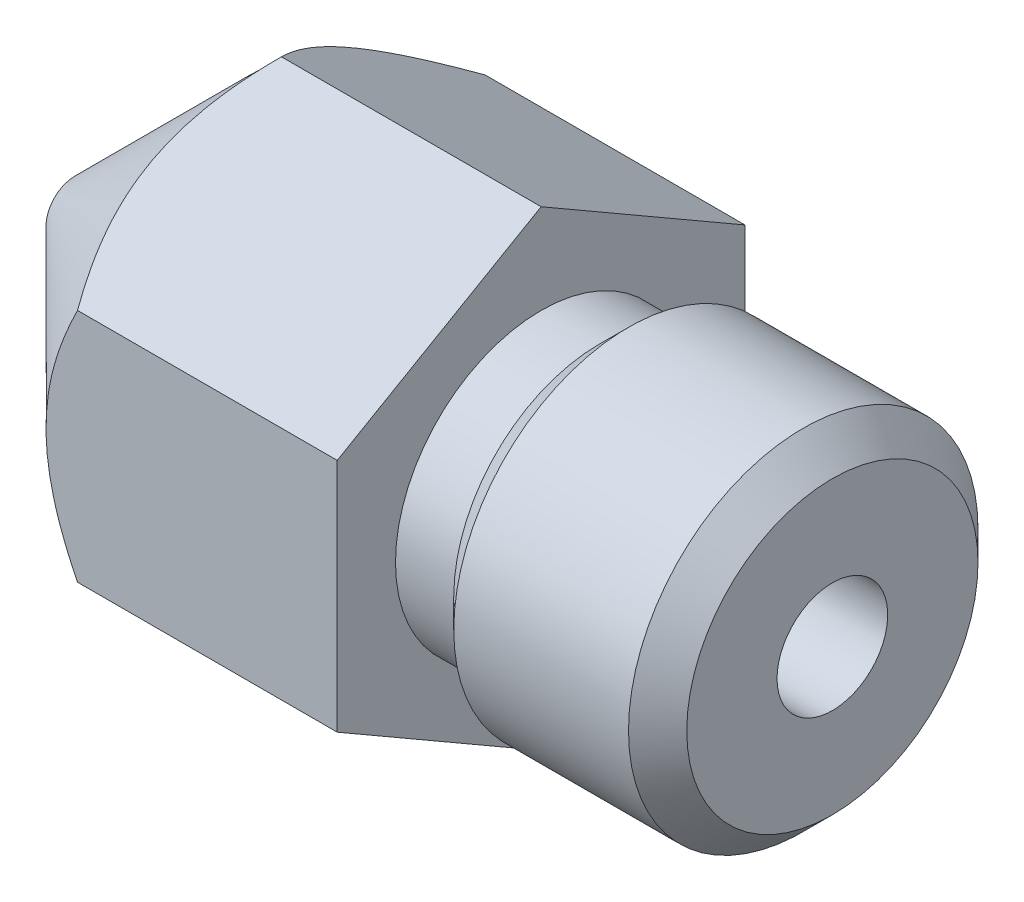
ISO-10303-21;
HEADER;
FILE_DESCRIPTION(('STEP AP214'),'2;1');
FILE_NAME('part.step','',(''),(''),'','','');
FILE_SCHEMA(('AUTOMOTIVE_DESIGN { 1 0 10303 214 1 1 1 1 }'));
ENDSEC;
DATA;
#1=APPLICATION_CONTEXT('core data for automotive mechanical design processes');
#2=APPLICATION_PROTOCOL_DEFINITION('international standard','automotive_design',2000,#1);
#3=PRODUCT_CONTEXT('',#1,'mechanical');
#4=PRODUCT('Part','Part','',(#3));
#5=PRODUCT_RELATED_PRODUCT_CATEGORY('part','',(#4));
#6=PRODUCT_DEFINITION_FORMATION('','',#4);
#7=PRODUCT_DEFINITION_CONTEXT('part definition',#1,'design');
#8=PRODUCT_DEFINITION('design','',#6,#7);
#9=PRODUCT_DEFINITION_SHAPE('','',#8);
#10=(LENGTH_UNIT() NAMED_UNIT(*) SI_UNIT(.MILLI.,.METRE.));
#11=(NAMED_UNIT(*) PLANE_ANGLE_UNIT() SI_UNIT($,.RADIAN.));
#12=(NAMED_UNIT(*) SI_UNIT($,.STERADIAN.) SOLID_ANGLE_UNIT());
#13=UNCERTAINTY_MEASURE_WITH_UNIT(LENGTH_MEASURE(1.E-05),#10,'distance_accuracy_value','');
#14=(GEOMETRIC_REPRESENTATION_CONTEXT(3) GLOBAL_UNCERTAINTY_ASSIGNED_CONTEXT((#13)) GLOBAL_UNIT_ASSIGNED_CONTEXT((#10,
#11,#12)) REPRESENTATION_CONTEXT('',''));
#15=CARTESIAN_POINT('',(0.,0.,0.));
#16=DIRECTION('',(0.,0.,1.));
#17=DIRECTION('',(1.,0.,0.));
#18=AXIS2_PLACEMENT_3D('',#15,#16,#17);
#19=CARTESIAN_POINT('',(8.,2.5,0.));
#20=DIRECTION('',(-1.,0.,0.));
#21=DIRECTION('',(0.,0.,1.));
#22=AXIS2_PLACEMENT_3D('',#19,#20,#21);
#23=PLANE('',#22);
#24=CARTESIAN_POINT('',(8.,0.,0.));
#25=DIRECTION('',(-1.,0.,0.));
#26=DIRECTION('',(0.,0.,1.));
#27=AXIS2_PLACEMENT_3D('',#24,#25,#26);
#28=CIRCLE('',#27,2.5);
#29=CARTESIAN_POINT('',(8.,0.,2.5));
#30=VERTEX_POINT('',#29);
#31=EDGE_CURVE('E131',#30,#30,#28,.T.);
#32=ORIENTED_EDGE('',*,*,#31,.T.);
#33=EDGE_LOOP('',(#32));
#34=FACE_BOUND('',#33,.T.);
#35=DIRECTION('',(0.,-1.,0.));
#36=VECTOR('',#35,1.);
#37=CARTESIAN_POINT('',(8.,2.02072594216369,3.5));
#38=LINE('',#37,#36);
#39=CARTESIAN_POINT('',(8.,2.02072594216369,3.5));
#40=VERTEX_POINT('',#39);
#41=CARTESIAN_POINT('',(8.,-2.02072594216369,3.5));
#42=VERTEX_POINT('',#41);
#43=EDGE_CURVE('E110',#40,#42,#38,.T.);
#44=ORIENTED_EDGE('',*,*,#43,.T.);
#45=DIRECTION('',(0.,-0.5,-0.866025403784439));
#46=VECTOR('',#45,1.);
#47=CARTESIAN_POINT('',(8.,-2.02072594216369,3.5));
#48=LINE('',#47,#46);
#49=CARTESIAN_POINT('',(8.,-4.04145188432738,0.));
#50=VERTEX_POINT('',#49);
#51=EDGE_CURVE('E108',#42,#50,#48,.T.);
#52=ORIENTED_EDGE('',*,*,#51,.T.);
#53=DIRECTION('',(0.,0.5,-0.866025403784439));
#54=VECTOR('',#53,1.);
#55=CARTESIAN_POINT('',(8.,-4.04145188432738,0.));
#56=LINE('',#55,#54);
#57=CARTESIAN_POINT('',(8.,-2.02072594216369,-3.5));
#58=VERTEX_POINT('',#57);
#59=EDGE_CURVE('E50',#50,#58,#56,.T.);
#60=ORIENTED_EDGE('',*,*,#59,.T.);
#61=DIRECTION('',(0.,1.,0.));
#62=VECTOR('',#61,1.);
#63=CARTESIAN_POINT('',(8.,-2.02072594216369,-3.5));
#64=LINE('',#63,#62);
#65=CARTESIAN_POINT('',(8.,2.02072594216369,-3.5));
#66=VERTEX_POINT('',#65);
#67=EDGE_CURVE('E98',#58,#66,#64,.T.);
#68=ORIENTED_EDGE('',*,*,#67,.T.);
#69=DIRECTION('',(0.,0.5,0.866025403784439));
#70=VECTOR('',#69,1.);
#71=CARTESIAN_POINT('',(8.,2.02072594216369,-3.5));
#72=LINE('',#71,#70);
#73=CARTESIAN_POINT('',(8.,4.04145188432738,0.));
#74=VERTEX_POINT('',#73);
#75=EDGE_CURVE('E104',#66,#74,#72,.T.);
#76=ORIENTED_EDGE('',*,*,#75,.T.);
#77=DIRECTION('',(0.,-0.5,0.866025403784439));
#78=VECTOR('',#77,1.);
#79=CARTESIAN_POINT('',(8.,4.04145188432738,0.));
#80=LINE('',#79,#78);
#81=EDGE_CURVE('E115',#74,#40,#80,.T.);
#82=ORIENTED_EDGE('',*,*,#81,.T.);
#83=EDGE_LOOP('',(#44,#52,#60,#68,#76,#82));
#84=FACE_BOUND('',#83,.T.);
#85=ADVANCED_FACE('F35',(#34,#84),#23,.F.);
#86=CARTESIAN_POINT('',(4.,0.,0.));
#87=DIRECTION('',(1.,0.,0.));
#88=DIRECTION('',(0.,0.,-1.));
#89=AXIS2_PLACEMENT_3D('',#86,#87,#88);
#90=CONICAL_SURFACE('',#89,4.5,0.78539816339745);
#91=CARTESIAN_POINT('',(0.,0.,0.));
#92=DIRECTION('',(-1.,0.,0.));
#93=DIRECTION('',(0.,0.,1.));
#94=AXIS2_PLACEMENT_3D('',#91,#92,#93);
#95=CIRCLE('',#94,0.499999999999984);
#96=CARTESIAN_POINT('',(0.,0.,0.499999999999984));
#97=VERTEX_POINT('',#96);
#98=EDGE_CURVE('E128',#97,#97,#95,.T.);
#99=ORIENTED_EDGE('',*,*,#98,.F.);
#100=EDGE_LOOP('',(#99));
#101=FACE_BOUND('',#100,.T.);
#102=CARTESIAN_POINT('',(5.60473460571073,-5.00177814443646,3.5));
#103=CARTESIAN_POINT('',(5.50158525305018,-4.87585100221837,3.5));
#104=CARTESIAN_POINT('',(5.39916732462682,-4.74931512243237,3.5));
#105=CARTESIAN_POINT('',(5.19618183428807,-4.49471658352455,3.5));
#106=CARTESIAN_POINT('',(5.09561475080956,-4.36665354335295,3.5));
#107=CARTESIAN_POINT('',(4.8956806099685,-4.1073404488107,3.5));
#108=CARTESIAN_POINT('',(4.79633882689846,-3.97607084326665,3.5));
#109=CARTESIAN_POINT('',(4.60061166670264,-3.71135912834578,3.5));
#110=CARTESIAN_POINT('',(4.50422600560764,-3.57791722953954,3.5));
#111=CARTESIAN_POINT('',(4.30644876507746,-3.29590423287125,3.5));
#112=CARTESIAN_POINT('',(4.20542063931455,-3.14707678989524,3.5));
#113=CARTESIAN_POINT('',(4.0092782092562,-2.84547482694549,3.5));
#114=CARTESIAN_POINT('',(3.91416582545941,-2.69269904772549,3.5));
#115=CARTESIAN_POINT('',(3.73242858701602,-2.38308612845867,3.5));
#116=CARTESIAN_POINT('',(3.64576650922454,-2.22627104221582,3.5));
#117=CARTESIAN_POINT('',(3.48347840457084,-1.90708387824138,3.5));
#118=CARTESIAN_POINT('',(3.4078428797255,-1.74471673355065,3.5));
#119=CARTESIAN_POINT('',(3.29115360790501,-1.46096984620552,3.5));
#120=CARTESIAN_POINT('',(3.24639235010286,-1.34112588832474,3.5));
#121=CARTESIAN_POINT('',(3.16645824704642,-1.09820885957048,3.5));
#122=CARTESIAN_POINT('',(3.13128671673046,-0.975135348396179,3.5));
#123=CARTESIAN_POINT('',(3.07315329237583,-0.728966718302567,3.5));
#124=CARTESIAN_POINT('',(3.04993834404319,-0.605932392197103,3.5));
#125=CARTESIAN_POINT('',(3.01613662323999,-0.358129563749721,3.5));
#126=CARTESIAN_POINT('',(3.00554687121748,-0.233361477610497,3.5));
#127=CARTESIAN_POINT('',(2.9980076393283,0.0101654253989616,3.5));
#128=CARTESIAN_POINT('',(3.0003849263801,0.128903431666411,3.5));
#129=CARTESIAN_POINT('',(3.01705527222058,0.365532552222858,3.5));
#130=CARTESIAN_POINT('',(3.03134918273084,0.483423605369748,3.5));
#131=CARTESIAN_POINT('',(3.07126805871322,0.719563148573866,3.5));
#132=CARTESIAN_POINT('',(3.09710502038985,0.83777515440585,3.5));
#133=CARTESIAN_POINT('',(3.15862164673052,1.07156228973921,3.5));
#134=CARTESIAN_POINT('',(3.19430109896366,1.1871374760929,3.5));
#135=CARTESIAN_POINT('',(3.27495249430218,1.41857905527411,3.5));
#136=CARTESIAN_POINT('',(3.32015561728366,1.53436386685402,3.5));
#137=CARTESIAN_POINT('',(3.41756542323519,1.7629573042304,3.5));
#138=CARTESIAN_POINT('',(3.46977427633029,1.87576499481178,3.5));
#139=CARTESIAN_POINT('',(3.57996695790531,2.09894682323399,3.5));
#140=CARTESIAN_POINT('',(3.63796861954407,2.20931208353451,3.5));
#141=CARTESIAN_POINT('',(3.75847190730103,2.42752018879847,3.5));
#142=CARTESIAN_POINT('',(3.82097285702742,2.53536340969175,3.5));
#143=CARTESIAN_POINT('',(3.94642001487544,2.74357548029041,3.5));
#144=CARTESIAN_POINT('',(4.00919138032335,2.8440502327273,3.5));
#145=CARTESIAN_POINT('',(4.13742428325754,3.04327327614903,3.5));
#146=CARTESIAN_POINT('',(4.20288602031573,3.14202143827798,3.5));
#147=CARTESIAN_POINT('',(4.33549374104825,3.33722918559784,3.5));
#148=CARTESIAN_POINT('',(4.40262218906713,3.43370072609763,3.5));
#149=CARTESIAN_POINT('',(4.53869269345195,3.62531773450166,3.5));
#150=CARTESIAN_POINT('',(4.60763424496689,3.72046356049015,3.5));
#151=CARTESIAN_POINT('',(4.67731849112517,3.81505265475415,3.5));
#152=B_SPLINE_CURVE_WITH_KNOTS('',3,(#102,#103,#104,#105,#106,#107,#108,#109,#110,#111,#112,
#113,#114,#115,#116,#117,#118,#119,#120,#121,#122,#123,#124,#125,#126,#127,#128,#129,#130,#131,
#132,#133,#134,#135,#136,#137,#138,#139,#140,#141,#142,#143,#144,#145,#146,#147,#148,#149,#150,
#151),.UNSPECIFIED.,.F.,.F.,(4,2,2,2,2,2,2,2,2,2,2,2,2,2,2,2,2,2,2,2,2,2,2,2,4),(0.,
0.488349249027166,0.976823010095185,1.47065642848088,1.96444225899961,2.50397255703355,
3.04367710477862,3.58088531780657,4.11762802448125,4.50109851017833,4.88462155073114,
5.25965435197999,5.63459862778907,5.99026775687149,6.34596230901475,6.70847660551895,
7.07098307847279,7.44358822460948,7.81630905811278,8.19021491747463,8.56406468333309,
8.91942809068196,9.27481790665746,9.62738125871665,9.97984745921805),.UNSPECIFIED.);
#153=CARTESIAN_POINT('',(3.54145188432738,2.02072594216369,3.5));
#154=VERTEX_POINT('',#153);
#155=CARTESIAN_POINT('',(3.54145188432738,-2.02072594216369,3.5));
#156=VERTEX_POINT('',#155);
#157=EDGE_CURVE('E176',#154,#156,#152,.F.);
#158=ORIENTED_EDGE('',*,*,#157,.F.);
#159=CARTESIAN_POINT('',(3.5415673593298,4.04156735438122,-0.000199999999999954));
#160=CARTESIAN_POINT('',(3.47216781805871,3.9721070606697,0.120108757817009));
#161=CARTESIAN_POINT('',(3.40684436318291,3.90148531215405,0.24242921436546));
#162=CARTESIAN_POINT('',(3.28723893601392,3.75747991147153,0.491853884911907));
#163=CARTESIAN_POINT('',(3.23302350720678,3.68408256574985,0.618981816842553));
#164=CARTESIAN_POINT('',(3.14015155956122,3.53608035685404,0.875329162282526));
#165=CARTESIAN_POINT('',(3.1012616245349,3.46151318117029,1.00448329914368));
#166=CARTESIAN_POINT('',(3.04134378872047,3.310737295381,1.26563479388695));
#167=CARTESIAN_POINT('',(3.02027116467501,3.2345331906662,1.39762417499828));
#168=CARTESIAN_POINT('',(3.00125799897574,3.10319782183117,1.62510370665135));
#169=CARTESIAN_POINT('',(2.99844358418733,3.04823615399913,1.72030010780516));
#170=CARTESIAN_POINT('',(3.00318657176733,2.93840222621347,1.91053805112478));
#171=CARTESIAN_POINT('',(3.0107476100844,2.88353000435281,2.00557952731163));
#172=CARTESIAN_POINT('',(3.03580978058179,2.77430542200351,2.1947620533761));
#173=CARTESIAN_POINT('',(3.0533220307075,2.71995371223668,2.2889019761705));
#174=CARTESIAN_POINT('',(3.09733078172171,2.61218376551827,2.47556499941577));
#175=CARTESIAN_POINT('',(3.12382659379173,2.55876545732784,2.56808822325597));
#176=CARTESIAN_POINT('',(3.17833985376172,2.46393368006795,2.73234167964216));
#177=CARTESIAN_POINT('',(3.20492418817716,2.42231028209655,2.80443551971228));
#178=CARTESIAN_POINT('',(3.26237725929072,2.33981072759411,2.9473289397123));
#179=CARTESIAN_POINT('',(3.29324612649086,2.29893459386684,3.01812848014492));
#180=CARTESIAN_POINT('',(3.35857622497152,2.21805834837751,3.15821024645785));
#181=CARTESIAN_POINT('',(3.39302615997836,2.17805593632086,3.22749645656528));
#182=CARTESIAN_POINT('',(3.46506598404272,2.09879193666161,3.36478573118621));
#183=CARTESIAN_POINT('',(3.50265394638793,2.05952991236255,3.43278955208019));
#184=CARTESIAN_POINT('',(3.5415673593298,2.02061047210985,3.5002));
#185=B_SPLINE_CURVE_WITH_KNOTS('',3,(#159,#160,#161,#162,#163,#164,#165,#166,#167,#168,#169,
#170,#171,#172,#173,#174,#175,#176,#177,#178,#179,#180,#181,#182,#183,#184),.UNSPECIFIED.,.F.,
.F.,(4,2,2,2,2,2,2,2,2,2,2,2,4),(0.,0.466195029511835,0.935106055247667,1.3965703522971,
1.85687285909025,2.18628459516077,2.51581179896772,2.845707891424,3.17557869467338,
3.43762138891189,3.69967206642681,3.96091985737577,4.22200840855896),.UNSPECIFIED.);
#186=CARTESIAN_POINT('',(3.54145188432739,4.04145188432738,0.));
#187=VERTEX_POINT('',#186);
#188=EDGE_CURVE('E183',#187,#154,#185,.T.);
#189=ORIENTED_EDGE('',*,*,#188,.F.);
#190=CARTESIAN_POINT('',(3.5415673593298,2.02061047210985,-3.5002));
#191=CARTESIAN_POINT('',(3.47216781805871,2.09007076582137,-3.37989124218299));
#192=CARTESIAN_POINT('',(3.40684436318291,2.16069251433702,-3.25757078563454));
#193=CARTESIAN_POINT('',(3.28723893601392,2.30469791501955,-3.0081461150881));
#194=CARTESIAN_POINT('',(3.23302350720678,2.37809526074122,-2.88101818315745));
#195=CARTESIAN_POINT('',(3.14015155956122,2.52609746963704,-2.62467083771748));
#196=CARTESIAN_POINT('',(3.1012616245349,2.60066464532078,-2.49551670085632));
#197=CARTESIAN_POINT('',(3.04134378872047,2.75144053111008,-2.23436520611305));
#198=CARTESIAN_POINT('',(3.02027116467501,2.82764463582488,-2.10237582500172));
#199=CARTESIAN_POINT('',(3.00125799897574,2.9589800046599,-1.87489629334866));
#200=CARTESIAN_POINT('',(2.99844358418733,3.01394167249194,-1.77969989219485));
#201=CARTESIAN_POINT('',(3.00318657176733,3.12377560027761,-1.58946194887522));
#202=CARTESIAN_POINT('',(3.0107476100844,3.17864782213826,-1.49442047268838));
#203=CARTESIAN_POINT('',(3.03580978058179,3.28787240448756,-1.3052379466239));
#204=CARTESIAN_POINT('',(3.0533220307075,3.34222411425439,-1.2110980238295));
#205=CARTESIAN_POINT('',(3.09733078172171,3.4499940609728,-1.02443500058423));
#206=CARTESIAN_POINT('',(3.12382659379173,3.50341236916323,-0.931911776744036));
#207=CARTESIAN_POINT('',(3.17833985376172,3.59824414642313,-0.767658320357845));
#208=CARTESIAN_POINT('',(3.20492418817716,3.63986754439453,-0.69556448028772));
#209=CARTESIAN_POINT('',(3.26237725929072,3.72236709889696,-0.552671060287704));
#210=CARTESIAN_POINT('',(3.29324612649086,3.76324323262424,-0.481871519855082));
#211=CARTESIAN_POINT('',(3.35857622497152,3.84411947811356,-0.341789753542154));
#212=CARTESIAN_POINT('',(3.39302615997836,3.88412189017022,-0.272503543434724));
#213=CARTESIAN_POINT('',(3.46506598404272,3.96338588982946,-0.135214268813787));
#214=CARTESIAN_POINT('',(3.50265394638793,4.00264791412852,-0.0672104479198107));
#215=CARTESIAN_POINT('',(3.5415673593298,4.04156735438122,0.00020000000000017));
#216=B_SPLINE_CURVE_WITH_KNOTS('',3,(#190,#191,#192,#193,#194,#195,#196,#197,#198,#199,#200,
#201,#202,#203,#204,#205,#206,#207,#208,#209,#210,#211,#212,#213,#214,#215),.UNSPECIFIED.,.F.,
.F.,(4,2,2,2,2,2,2,2,2,2,2,2,4),(0.,0.466195029511835,0.935106055247667,1.3965703522971,
1.85687285909025,2.18628459516076,2.51581179896771,2.845707891424,3.17557869467337,
3.43762138891189,3.69967206642681,3.96091985737577,4.22200840855896),.UNSPECIFIED.);
#217=CARTESIAN_POINT('',(3.54145188432739,2.02072594216369,-3.5));
#218=VERTEX_POINT('',#217);
#219=EDGE_CURVE('E250',#218,#187,#216,.T.);
#220=ORIENTED_EDGE('',*,*,#219,.F.);
#221=CARTESIAN_POINT('',(5.60473460571074,-5.00177814443646,-3.5));
#222=CARTESIAN_POINT('',(5.50158525305018,-4.87585100221837,-3.5));
#223=CARTESIAN_POINT('',(5.39916732462683,-4.74931512243238,-3.5));
#224=CARTESIAN_POINT('',(5.19618183428808,-4.49471658352455,-3.5));
#225=CARTESIAN_POINT('',(5.09561475080957,-4.36665354335295,-3.5));
#226=CARTESIAN_POINT('',(4.8956806099685,-4.1073404488107,-3.5));
#227=CARTESIAN_POINT('',(4.79633882689846,-3.97607084326666,-3.5));
#228=CARTESIAN_POINT('',(4.60061166670265,-3.71135912834578,-3.5));
#229=CARTESIAN_POINT('',(4.50422600560765,-3.57791722953954,-3.5));
#230=CARTESIAN_POINT('',(4.30644876507746,-3.29590423287125,-3.5));
#231=CARTESIAN_POINT('',(4.20542063931455,-3.14707678989524,-3.5));
#232=CARTESIAN_POINT('',(4.00927820925621,-2.84547482694549,-3.5));
#233=CARTESIAN_POINT('',(3.91416582545942,-2.69269904772549,-3.5));
#234=CARTESIAN_POINT('',(3.73242858701603,-2.38308612845867,-3.5));
#235=CARTESIAN_POINT('',(3.64576650922454,-2.22627104221582,-3.5));
#236=CARTESIAN_POINT('',(3.48347840457084,-1.90708387824137,-3.5));
#237=CARTESIAN_POINT('',(3.4078428797255,-1.74471673355065,-3.5));
#238=CARTESIAN_POINT('',(3.29115360790502,-1.46096984620551,-3.5));
#239=CARTESIAN_POINT('',(3.24639235010286,-1.34112588832474,-3.5));
#240=CARTESIAN_POINT('',(3.16645824704642,-1.09820885957048,-3.5));
#241=CARTESIAN_POINT('',(3.13128671673046,-0.975135348396178,-3.5));
#242=CARTESIAN_POINT('',(3.07315329237583,-0.728966718302567,-3.5));
#243=CARTESIAN_POINT('',(3.04993834404319,-0.605932392197102,-3.5));
#244=CARTESIAN_POINT('',(3.01613662324,-0.358129563749721,-3.5));
#245=CARTESIAN_POINT('',(3.00554687121749,-0.233361477610496,-3.5));
#246=CARTESIAN_POINT('',(2.9980076393283,0.0101654253989624,-3.5));
#247=CARTESIAN_POINT('',(3.0003849263801,0.128903431666412,-3.5));
#248=CARTESIAN_POINT('',(3.01705527222059,0.365532552222859,-3.5));
#249=CARTESIAN_POINT('',(3.03134918273085,0.48342360536975,-3.5));
#250=CARTESIAN_POINT('',(3.07126805871322,0.719563148573868,-3.5));
#251=CARTESIAN_POINT('',(3.09710502038985,0.837775154405851,-3.5));
#252=CARTESIAN_POINT('',(3.15862164673053,1.07156228973921,-3.5));
#253=CARTESIAN_POINT('',(3.19430109896366,1.1871374760929,-3.5));
#254=CARTESIAN_POINT('',(3.27495249430218,1.41857905527411,-3.5));
#255=CARTESIAN_POINT('',(3.32015561728366,1.53436386685402,-3.5));
#256=CARTESIAN_POINT('',(3.41756542323519,1.76295730423041,-3.5));
#257=CARTESIAN_POINT('',(3.4697742763303,1.87576499481178,-3.5));
#258=CARTESIAN_POINT('',(3.57996695790532,2.09894682323399,-3.5));
#259=CARTESIAN_POINT('',(3.63796861954407,2.20931208353452,-3.5));
#260=CARTESIAN_POINT('',(3.75847190730104,2.42752018879848,-3.5));
#261=CARTESIAN_POINT('',(3.82097285702742,2.53536340969176,-3.5));
#262=CARTESIAN_POINT('',(3.94642001487544,2.74357548029041,-3.5));
#263=CARTESIAN_POINT('',(4.00919138032335,2.84405023272731,-3.5));
#264=CARTESIAN_POINT('',(4.13742428325754,3.04327327614903,-3.5));
#265=CARTESIAN_POINT('',(4.20288602031574,3.14202143827798,-3.5));
#266=CARTESIAN_POINT('',(4.33549374104825,3.33722918559784,-3.5));
#267=CARTESIAN_POINT('',(4.40262218906713,3.43370072609764,-3.5));
#268=CARTESIAN_POINT('',(4.53869269345195,3.62531773450166,-3.5));
#269=CARTESIAN_POINT('',(4.6076342449669,3.72046356049016,-3.5));
#270=CARTESIAN_POINT('',(4.67731849112518,3.81505265475415,-3.5));
#271=B_SPLINE_CURVE_WITH_KNOTS('',3,(#221,#222,#223,#224,#225,#226,#227,#228,#229,#230,#231,
#232,#233,#234,#235,#236,#237,#238,#239,#240,#241,#242,#243,#244,#245,#246,#247,#248,#249,#250,
#251,#252,#253,#254,#255,#256,#257,#258,#259,#260,#261,#262,#263,#264,#265,#266,#267,#268,#269,
#270),.UNSPECIFIED.,.F.,.F.,(4,2,2,2,2,2,2,2,2,2,2,2,2,2,2,2,2,2,2,2,2,2,2,2,4),(0.,
0.488349249027167,0.976823010095186,1.47065642848089,1.96444225899962,2.50397255703356,
3.04367710477862,3.58088531780658,4.11762802448125,4.50109851017834,4.88462155073114,
5.25965435197999,5.63459862778907,5.99026775687149,6.34596230901476,6.70847660551895,
7.0709830784728,7.44358822460949,7.81630905811279,8.19021491747464,8.56406468333311,
8.91942809068197,9.27481790665748,9.62738125871667,9.97984745921806),.UNSPECIFIED.);
#272=CARTESIAN_POINT('',(3.54145188432739,-2.02072594216369,-3.5));
#273=VERTEX_POINT('',#272);
#274=EDGE_CURVE('E251',#273,#218,#271,.T.);
#275=ORIENTED_EDGE('',*,*,#274,.F.);
#276=CARTESIAN_POINT('',(3.5415673593298,-4.04156735438122,0.000199999999996348));
#277=CARTESIAN_POINT('',(3.47216781805871,-3.9721070606697,-0.120108757817013));
#278=CARTESIAN_POINT('',(3.40684436318291,-3.90148531215405,-0.242429214365463));
#279=CARTESIAN_POINT('',(3.28723893601391,-3.75747991147153,-0.491853884911911));
#280=CARTESIAN_POINT('',(3.23302350720678,-3.68408256574985,-0.618981816842557));
#281=CARTESIAN_POINT('',(3.14015155956122,-3.53608035685404,-0.87532916228253));
#282=CARTESIAN_POINT('',(3.10126162453491,-3.46151318117029,-1.00448329914369));
#283=CARTESIAN_POINT('',(3.04134378872047,-3.310737295381,-1.26563479388695));
#284=CARTESIAN_POINT('',(3.02027116467501,-3.2345331906662,-1.39762417499828));
#285=CARTESIAN_POINT('',(3.00125799897574,-3.10319782183117,-1.62510370665135));
#286=CARTESIAN_POINT('',(2.99844358418733,-3.04823615399913,-1.72030010780516));
#287=CARTESIAN_POINT('',(3.00318657176733,-2.93840222621347,-1.91053805112479));
#288=CARTESIAN_POINT('',(3.0107476100844,-2.88353000435281,-2.00557952731163));
#289=CARTESIAN_POINT('',(3.03580978058179,-2.77430542200351,-2.1947620533761));
#290=CARTESIAN_POINT('',(3.0533220307075,-2.71995371223668,-2.2889019761705));
#291=CARTESIAN_POINT('',(3.09733078172171,-2.61218376551827,-2.47556499941577));
#292=CARTESIAN_POINT('',(3.12382659379174,-2.55876545732784,-2.56808822325597));
#293=CARTESIAN_POINT('',(3.17833985376172,-2.46393368006795,-2.73234167964216));
#294=CARTESIAN_POINT('',(3.20492418817716,-2.42231028209655,-2.80443551971228));
#295=CARTESIAN_POINT('',(3.26237725929072,-2.33981072759411,-2.9473289397123));
#296=CARTESIAN_POINT('',(3.29324612649086,-2.29893459386684,-3.01812848014492));
#297=CARTESIAN_POINT('',(3.35857622497152,-2.21805834837751,-3.15821024645785));
#298=CARTESIAN_POINT('',(3.39302615997836,-2.17805593632086,-3.22749645656528));
#299=CARTESIAN_POINT('',(3.46506598404272,-2.09879193666161,-3.36478573118622));
#300=CARTESIAN_POINT('',(3.50265394638794,-2.05952991236255,-3.43278955208019));
#301=CARTESIAN_POINT('',(3.5415673593298,-2.02061047210985,-3.5002));
#302=B_SPLINE_CURVE_WITH_KNOTS('',3,(#276,#277,#278,#279,#280,#281,#282,#283,#284,#285,#286,
#287,#288,#289,#290,#291,#292,#293,#294,#295,#296,#297,#298,#299,#300,#301),.UNSPECIFIED.,.F.,
.F.,(4,2,2,2,2,2,2,2,2,2,2,2,4),(0.,0.466195029511834,0.935106055247666,1.3965703522971,
1.85687285909025,2.18628459516076,2.51581179896771,2.845707891424,3.17557869467337,
3.43762138891189,3.69967206642681,3.96091985737577,4.22200840855895),.UNSPECIFIED.);
#303=CARTESIAN_POINT('',(3.54145188432738,-4.04145188432738,0.));
#304=VERTEX_POINT('',#303);
#305=EDGE_CURVE('E91',#304,#273,#302,.T.);
#306=ORIENTED_EDGE('',*,*,#305,.F.);
#307=CARTESIAN_POINT('',(3.5415673593298,-2.02061047210985,3.5002));
#308=CARTESIAN_POINT('',(3.47216781805871,-2.09007076582137,3.37989124218299));
#309=CARTESIAN_POINT('',(3.40684436318291,-2.16069251433702,3.25757078563454));
#310=CARTESIAN_POINT('',(3.28723893601391,-2.30469791501954,3.00814611508809));
#311=CARTESIAN_POINT('',(3.23302350720678,-2.37809526074122,2.88101818315745));
#312=CARTESIAN_POINT('',(3.14015155956122,-2.52609746963704,2.62467083771747));
#313=CARTESIAN_POINT('',(3.1012616245349,-2.60066464532078,2.49551670085632));
#314=CARTESIAN_POINT('',(3.04134378872046,-2.75144053111008,2.23436520611305));
#315=CARTESIAN_POINT('',(3.02027116467501,-2.82764463582488,2.10237582500172));
#316=CARTESIAN_POINT('',(3.00125799897574,-2.9589800046599,1.87489629334865));
#317=CARTESIAN_POINT('',(2.99844358418733,-3.01394167249194,1.77969989219484));
#318=CARTESIAN_POINT('',(3.00318657176733,-3.12377560027761,1.58946194887522));
#319=CARTESIAN_POINT('',(3.0107476100844,-3.17864782213826,1.49442047268837));
#320=CARTESIAN_POINT('',(3.03580978058179,-3.28787240448756,1.3052379466239));
#321=CARTESIAN_POINT('',(3.05332203070749,-3.34222411425439,1.2110980238295));
#322=CARTESIAN_POINT('',(3.09733078172171,-3.4499940609728,1.02443500058423));
#323=CARTESIAN_POINT('',(3.12382659379173,-3.50341236916323,0.931911776744033));
#324=CARTESIAN_POINT('',(3.17833985376171,-3.59824414642312,0.767658320357841));
#325=CARTESIAN_POINT('',(3.20492418817716,-3.63986754439452,0.695564480287717));
#326=CARTESIAN_POINT('',(3.26237725929072,-3.72236709889696,0.552671060287701));
#327=CARTESIAN_POINT('',(3.29324612649085,-3.76324323262424,0.481871519855078));
#328=CARTESIAN_POINT('',(3.35857622497152,-3.84411947811356,0.341789753542151));
#329=CARTESIAN_POINT('',(3.39302615997836,-3.88412189017022,0.27250354343472));
#330=CARTESIAN_POINT('',(3.46506598404272,-3.96338588982946,0.135214268813784));
#331=CARTESIAN_POINT('',(3.50265394638793,-4.00264791412852,0.0672104479198071));
#332=CARTESIAN_POINT('',(3.5415673593298,-4.04156735438122,-0.000200000000003697));
#333=B_SPLINE_CURVE_WITH_KNOTS('',3,(#307,#308,#309,#310,#311,#312,#313,#314,#315,#316,#317,
#318,#319,#320,#321,#322,#323,#324,#325,#326,#327,#328,#329,#330,#331,#332),.UNSPECIFIED.,.F.,
.F.,(4,2,2,2,2,2,2,2,2,2,2,2,4),(0.,0.466195029511835,0.935106055247667,1.3965703522971,
1.85687285909025,2.18628459516077,2.51581179896772,2.845707891424,3.17557869467338,
3.43762138891189,3.69967206642681,3.96091985737577,4.22200840855896),.UNSPECIFIED.);
#334=EDGE_CURVE('E146',#156,#304,#333,.T.);
#335=ORIENTED_EDGE('',*,*,#334,.F.);
#336=EDGE_LOOP('',(#158,#189,#220,#275,#306,#335));
#337=FACE_BOUND('',#336,.T.);
#338=ADVANCED_FACE('F158',(#101,#337),#90,.T.);
#339=CARTESIAN_POINT('',(0.,0.,0.));
#340=DIRECTION('',(-1.,0.,0.));
#341=DIRECTION('',(0.,0.,1.));
#342=AXIS2_PLACEMENT_3D('',#339,#340,#341);
#343=CYLINDRICAL_SURFACE('',#342,0.2);
#344=CARTESIAN_POINT('',(1.25,0.,0.));
#345=DIRECTION('',(-1.,0.,0.));
#346=DIRECTION('',(0.,0.,1.));
#347=AXIS2_PLACEMENT_3D('',#344,#345,#346);
#348=CIRCLE('',#347,0.2);
#349=CARTESIAN_POINT('',(1.25,0.,-0.2));
#350=VERTEX_POINT('',#349);
#351=EDGE_CURVE('E143',#350,#350,#348,.T.);
#352=ORIENTED_EDGE('',*,*,#351,.F.);
#353=EDGE_LOOP('',(#352));
#354=FACE_BOUND('',#353,.T.);
#355=CARTESIAN_POINT('',(0.,0.,0.));
#356=DIRECTION('',(-1.,0.,0.));
#357=DIRECTION('',(0.,0.,1.));
#358=AXIS2_PLACEMENT_3D('',#355,#356,#357);
#359=CIRCLE('',#358,0.2);
#360=CARTESIAN_POINT('',(0.,0.,0.2));
#361=VERTEX_POINT('',#360);
#362=EDGE_CURVE('E120',#361,#361,#359,.T.);
#363=ORIENTED_EDGE('',*,*,#362,.T.);
#364=EDGE_LOOP('',(#363));
#365=FACE_BOUND('',#364,.T.);
#366=ADVANCED_FACE('F209',(#354,#365),#343,.F.);
#367=CARTESIAN_POINT('',(1.25,0.,0.));
#368=DIRECTION('',(1.,0.,0.));
#369=DIRECTION('',(0.,0.,-1.));
#370=AXIS2_PLACEMENT_3D('',#367,#368,#369);
#371=CONICAL_SURFACE('',#370,0.2,0.78539816339745);
#372=CARTESIAN_POINT('',(2.,0.,0.));
#373=DIRECTION('',(-1.,0.,0.));
#374=DIRECTION('',(0.,0.,1.));
#375=AXIS2_PLACEMENT_3D('',#372,#373,#374);
#376=CIRCLE('',#375,0.95);
#377=CARTESIAN_POINT('',(2.,0.,-0.95));
#378=VERTEX_POINT('',#377);
#379=EDGE_CURVE('E140',#378,#378,#376,.T.);
#380=CARTESIAN_POINT('',(2.,0.,-0.95));
#381=CARTESIAN_POINT('',(1.9921875,0.,-0.9421875));
#382=CARTESIAN_POINT('',(1.984375,0.,-0.934375));
#383=CARTESIAN_POINT('',(1.96875,0.,-0.91875));
#384=CARTESIAN_POINT('',(1.9609375,0.,-0.9109375));
#385=CARTESIAN_POINT('',(1.9453125,0.,-0.8953125));
#386=CARTESIAN_POINT('',(1.9375,0.,-0.8875));
#387=CARTESIAN_POINT('',(1.921875,0.,-0.871875));
#388=CARTESIAN_POINT('',(1.9140625,0.,-0.8640625));
#389=CARTESIAN_POINT('',(1.8984375,0.,-0.8484375));
#390=CARTESIAN_POINT('',(1.890625,0.,-0.840625));
#391=CARTESIAN_POINT('',(1.875,0.,-0.825));
#392=CARTESIAN_POINT('',(1.8671875,0.,-0.8171875));
#393=CARTESIAN_POINT('',(1.8515625,0.,-0.8015625));
#394=CARTESIAN_POINT('',(1.84375,0.,-0.79375));
#395=CARTESIAN_POINT('',(1.828125,0.,-0.778125));
#396=CARTESIAN_POINT('',(1.8203125,0.,-0.7703125));
#397=CARTESIAN_POINT('',(1.8046875,0.,-0.7546875));
#398=CARTESIAN_POINT('',(1.796875,0.,-0.746875));
#399=CARTESIAN_POINT('',(1.78125,0.,-0.73125));
#400=CARTESIAN_POINT('',(1.7734375,0.,-0.7234375));
#401=CARTESIAN_POINT('',(1.7578125,0.,-0.7078125));
#402=CARTESIAN_POINT('',(1.75,0.,-0.7));
#403=CARTESIAN_POINT('',(1.734375,0.,-0.684375));
#404=CARTESIAN_POINT('',(1.7265625,0.,-0.6765625));
#405=CARTESIAN_POINT('',(1.7109375,0.,-0.6609375));
#406=CARTESIAN_POINT('',(1.703125,0.,-0.653125));
#407=CARTESIAN_POINT('',(1.6875,0.,-0.6375));
#408=CARTESIAN_POINT('',(1.6796875,0.,-0.6296875));
#409=CARTESIAN_POINT('',(1.6640625,0.,-0.6140625));
#410=CARTESIAN_POINT('',(1.65625,0.,-0.60625));
#411=CARTESIAN_POINT('',(1.640625,0.,-0.590625));
#412=CARTESIAN_POINT('',(1.6328125,0.,-0.5828125));
#413=CARTESIAN_POINT('',(1.6171875,0.,-0.5671875));
#414=CARTESIAN_POINT('',(1.609375,0.,-0.559375));
#415=CARTESIAN_POINT('',(1.59375,0.,-0.54375));
#416=CARTESIAN_POINT('',(1.5859375,0.,-0.5359375));
#417=CARTESIAN_POINT('',(1.5703125,0.,-0.5203125));
#418=CARTESIAN_POINT('',(1.5625,0.,-0.5125));
#419=CARTESIAN_POINT('',(1.546875,0.,-0.496875));
#420=CARTESIAN_POINT('',(1.5390625,0.,-0.4890625));
#421=CARTESIAN_POINT('',(1.5234375,0.,-0.4734375));
#422=CARTESIAN_POINT('',(1.515625,0.,-0.465625));
#423=CARTESIAN_POINT('',(1.5,0.,-0.45));
#424=CARTESIAN_POINT('',(1.4921875,0.,-0.4421875));
#425=CARTESIAN_POINT('',(1.4765625,0.,-0.4265625));
#426=CARTESIAN_POINT('',(1.46875,0.,-0.41875));
#427=CARTESIAN_POINT('',(1.453125,0.,-0.403125));
#428=CARTESIAN_POINT('',(1.4453125,0.,-0.3953125));
#429=CARTESIAN_POINT('',(1.4296875,0.,-0.3796875));
#430=CARTESIAN_POINT('',(1.421875,0.,-0.371875));
#431=CARTESIAN_POINT('',(1.40625,0.,-0.35625));
#432=CARTESIAN_POINT('',(1.3984375,0.,-0.3484375));
#433=CARTESIAN_POINT('',(1.3828125,0.,-0.3328125));
#434=CARTESIAN_POINT('',(1.375,0.,-0.325));
#435=CARTESIAN_POINT('',(1.359375,0.,-0.309375));
#436=CARTESIAN_POINT('',(1.3515625,0.,-0.3015625));
#437=CARTESIAN_POINT('',(1.3359375,0.,-0.2859375));
#438=CARTESIAN_POINT('',(1.328125,0.,-0.278125));
#439=CARTESIAN_POINT('',(1.3125,0.,-0.2625));
#440=CARTESIAN_POINT('',(1.3046875,0.,-0.2546875));
#441=CARTESIAN_POINT('',(1.2890625,0.,-0.2390625));
#442=CARTESIAN_POINT('',(1.28125,0.,-0.23125));
#443=CARTESIAN_POINT('',(1.265625,0.,-0.215625));
#444=CARTESIAN_POINT('',(1.2578125,0.,-0.2078125));
#445=CARTESIAN_POINT('',(1.25,0.,-0.2));
#446=B_SPLINE_CURVE_WITH_KNOTS('',3,(#380,#381,#382,#383,#384,#385,#386,#387,#388,#389,#390,
#391,#392,#393,#394,#395,#396,#397,#398,#399,#400,#401,#402,#403,#404,#405,#406,#407,#408,#409,
#410,#411,#412,#413,#414,#415,#416,#417,#418,#419,#420,#421,#422,#423,#424,#425,#426,#427,#428,
#429,#430,#431,#432,#433,#434,#435,#436,#437,#438,#439,#440,#441,#442,#443,#444,#445),
.UNSPECIFIED.,.F.,.F.,(4,2,2,2,2,2,2,2,2,2,2,2,2,2,2,2,2,2,2,2,2,2,2,2,2,2,2,2,2,2,2,2,4),(0.,
0.0331456303681191,0.0662912607362385,0.099436891104358,0.132582521472477,0.165728151840597,
0.198873782208716,0.232019412576835,0.265165042944955,0.298310673313074,0.331456303681194,
0.364601934049313,0.397747564417432,0.430893194785552,0.464038825153671,0.49718445552179,
0.53033008588991,0.563475716258029,0.596621346626149,0.629766976994268,0.662912607362387,
0.696058237730507,0.729203868098626,0.762349498466745,0.795495128834865,0.828640759202984,
0.861786389571103,0.894932019939223,0.928077650307342,0.961223280675462,0.994368911043581,
1.0275145414117,1.06066017177982),.UNSPECIFIED.);
#447=EDGE_CURVE('BSEAM225',#378,#350,#446,.T.);
#448=ORIENTED_EDGE('',*,*,#379,.F.);
#449=ORIENTED_EDGE('',*,*,#351,.T.);
#450=ORIENTED_EDGE('',*,*,#447,.T.);
#451=ORIENTED_EDGE('',*,*,#447,.F.);
#452=EDGE_LOOP('',(#448,#450,#449,#451));
#453=FACE_BOUND('',#452,.T.);
#454=ADVANCED_FACE('F225',(#453),#371,.F.);
#455=CARTESIAN_POINT('',(0.,0.,0.));
#456=DIRECTION('',(-1.,0.,0.));
#457=DIRECTION('',(0.,0.,1.));
#458=AXIS2_PLACEMENT_3D('',#455,#456,#457);
#459=CYLINDRICAL_SURFACE('',#458,0.95);
#460=CARTESIAN_POINT('',(13.,0.,0.));
#461=DIRECTION('',(-1.,0.,0.));
#462=DIRECTION('',(0.,0.,1.));
#463=AXIS2_PLACEMENT_3D('',#460,#461,#462);
#464=CIRCLE('',#463,0.95);
#465=CARTESIAN_POINT('',(13.,0.,0.95));
#466=VERTEX_POINT('',#465);
#467=EDGE_CURVE('E137',#466,#466,#464,.T.);
#468=ORIENTED_EDGE('',*,*,#467,.F.);
#469=EDGE_LOOP('',(#468));
#470=FACE_BOUND('',#469,.T.);
#471=ORIENTED_EDGE('',*,*,#379,.T.);
#472=EDGE_LOOP('',(#471));
#473=FACE_BOUND('',#472,.T.);
#474=ADVANCED_FACE('F221',(#470,#473),#459,.F.);
#475=CARTESIAN_POINT('',(13.,0.95,0.));
#476=DIRECTION('',(-1.,0.,0.));
#477=DIRECTION('',(0.,0.,1.));
#478=AXIS2_PLACEMENT_3D('',#475,#476,#477);
#479=PLANE('',#478);
#480=CARTESIAN_POINT('',(13.,0.,0.));
#481=DIRECTION('',(-1.,0.,0.));
#482=DIRECTION('',(0.,0.,1.));
#483=AXIS2_PLACEMENT_3D('',#480,#481,#482);
#484=CIRCLE('',#483,2.5);
#485=CARTESIAN_POINT('',(13.,0.,2.5));
#486=VERTEX_POINT('',#485);
#487=EDGE_CURVE('E12',#486,#486,#484,.F.);
#488=ORIENTED_EDGE('',*,*,#487,.T.);
#489=EDGE_LOOP('',(#488));
#490=FACE_BOUND('',#489,.T.);
#491=ORIENTED_EDGE('',*,*,#467,.T.);
#492=EDGE_LOOP('',(#491));
#493=FACE_BOUND('',#492,.T.);
#494=ADVANCED_FACE('F218',(#490,#493),#479,.F.);
#495=CARTESIAN_POINT('',(0.,0.,0.));
#496=DIRECTION('',(-1.,0.,0.));
#497=DIRECTION('',(0.,0.,1.));
#498=AXIS2_PLACEMENT_3D('',#495,#496,#497);
#499=CYLINDRICAL_SURFACE('',#498,3.);
#500=CARTESIAN_POINT('',(12.5,0.,0.));
#501=DIRECTION('',(-1.,0.,0.));
#502=DIRECTION('',(0.,0.,1.));
#503=AXIS2_PLACEMENT_3D('',#500,#501,#502);
#504=CIRCLE('',#503,3.);
#505=CARTESIAN_POINT('',(12.5,0.,3.));
#506=VERTEX_POINT('',#505);
#507=EDGE_CURVE('E43',#506,#506,#504,.T.);
#508=ORIENTED_EDGE('',*,*,#507,.T.);
#509=EDGE_LOOP('',(#508));
#510=FACE_BOUND('',#509,.T.);
#511=CARTESIAN_POINT('',(9.5,0.,0.));
#512=DIRECTION('',(1.,0.,0.));
#513=DIRECTION('',(0.,0.,-1.));
#514=AXIS2_PLACEMENT_3D('',#511,#512,#513);
#515=CIRCLE('',#514,3.);
#516=CARTESIAN_POINT('',(9.5,0.,-3.));
#517=VERTEX_POINT('',#516);
#518=EDGE_CURVE('E182',#517,#517,#515,.T.);
#519=ORIENTED_EDGE('',*,*,#518,.T.);
#520=EDGE_LOOP('',(#519));
#521=FACE_BOUND('',#520,.T.);
#522=ADVANCED_FACE('F193',(#510,#521),#499,.T.);
#523=CARTESIAN_POINT('',(0.,0.,0.));
#524=DIRECTION('',(-1.,0.,0.));
#525=DIRECTION('',(0.,0.,1.));
#526=AXIS2_PLACEMENT_3D('',#523,#524,#525);
#527=CYLINDRICAL_SURFACE('',#526,2.5);
#528=ORIENTED_EDGE('',*,*,#31,.F.);
#529=EDGE_LOOP('',(#528));
#530=FACE_BOUND('',#529,.T.);
#531=CARTESIAN_POINT('',(9.,0.,0.));
#532=DIRECTION('',(-1.,0.,0.));
#533=DIRECTION('',(0.,0.,1.));
#534=AXIS2_PLACEMENT_3D('',#531,#532,#533);
#535=CIRCLE('',#534,2.5);
#536=CARTESIAN_POINT('',(9.,0.,2.5));
#537=VERTEX_POINT('',#536);
#538=EDGE_CURVE('E134',#537,#537,#535,.T.);
#539=ORIENTED_EDGE('',*,*,#538,.T.);
#540=EDGE_LOOP('',(#539));
#541=FACE_BOUND('',#540,.T.);
#542=ADVANCED_FACE('F212',(#530,#541),#527,.T.);
#543=CARTESIAN_POINT('',(0.,0.499999999999984,0.));
#544=DIRECTION('',(1.,0.,0.));
#545=DIRECTION('',(0.,0.,-1.));
#546=AXIS2_PLACEMENT_3D('',#543,#544,#545);
#547=PLANE('',#546);
#548=ORIENTED_EDGE('',*,*,#362,.F.);
#549=EDGE_LOOP('',(#548));
#550=FACE_BOUND('',#549,.T.);
#551=ORIENTED_EDGE('',*,*,#98,.T.);
#552=EDGE_LOOP('',(#551));
#553=FACE_BOUND('',#552,.T.);
#554=ADVANCED_FACE('F173',(#550,#553),#547,.F.);
#555=CARTESIAN_POINT('',(-2.,2.02072594216369,3.5));
#556=DIRECTION('',(0.,0.,1.));
#557=DIRECTION('',(0.,-1.,0.));
#558=AXIS2_PLACEMENT_3D('',#555,#556,#557);
#559=PLANE('',#558);
#560=ORIENTED_EDGE('',*,*,#157,.T.);
#561=DIRECTION('',(1.,0.,0.));
#562=VECTOR('',#561,1.);
#563=CARTESIAN_POINT('',(-2.,-2.02072594216369,3.5));
#564=LINE('',#563,#562);
#565=EDGE_CURVE('E58',#156,#42,#564,.T.);
#566=ORIENTED_EDGE('',*,*,#565,.T.);
#567=ORIENTED_EDGE('',*,*,#43,.F.);
#568=DIRECTION('',(1.,0.,0.));
#569=VECTOR('',#568,1.);
#570=CARTESIAN_POINT('',(-2.,2.02072594216369,3.5));
#571=LINE('',#570,#569);
#572=EDGE_CURVE('E118',#154,#40,#571,.T.);
#573=ORIENTED_EDGE('',*,*,#572,.F.);
#574=EDGE_LOOP('',(#560,#566,#567,#573));
#575=FACE_BOUND('',#574,.T.);
#576=ADVANCED_FACE('F169',(#575),#559,.T.);
#577=CARTESIAN_POINT('',(-2.,4.04145188432738,0.));
#578=DIRECTION('',(0.,0.866025403784439,0.5));
#579=DIRECTION('',(0.,-0.5,0.866025403784439));
#580=AXIS2_PLACEMENT_3D('',#577,#578,#579);
#581=PLANE('',#580);
#582=ORIENTED_EDGE('',*,*,#188,.T.);
#583=ORIENTED_EDGE('',*,*,#572,.T.);
#584=ORIENTED_EDGE('',*,*,#81,.F.);
#585=DIRECTION('',(1.,0.,0.));
#586=VECTOR('',#585,1.);
#587=CARTESIAN_POINT('',(-2.,4.04145188432738,0.));
#588=LINE('',#587,#586);
#589=EDGE_CURVE('E121',#187,#74,#588,.T.);
#590=ORIENTED_EDGE('',*,*,#589,.F.);
#591=EDGE_LOOP('',(#582,#583,#584,#590));
#592=FACE_BOUND('',#591,.T.);
#593=ADVANCED_FACE('F172',(#592),#581,.T.);
#594=CARTESIAN_POINT('',(-2.,2.02072594216369,-3.5));
#595=DIRECTION('',(0.,0.866025403784439,-0.5));
#596=DIRECTION('',(0.,0.5,0.866025403784439));
#597=AXIS2_PLACEMENT_3D('',#594,#595,#596);
#598=PLANE('',#597);
#599=ORIENTED_EDGE('',*,*,#219,.T.);
#600=ORIENTED_EDGE('',*,*,#589,.T.);
#601=ORIENTED_EDGE('',*,*,#75,.F.);
#602=DIRECTION('',(1.,0.,0.));
#603=VECTOR('',#602,1.);
#604=CARTESIAN_POINT('',(-2.,2.02072594216369,-3.5));
#605=LINE('',#604,#603);
#606=EDGE_CURVE('E94',#218,#66,#605,.T.);
#607=ORIENTED_EDGE('',*,*,#606,.F.);
#608=EDGE_LOOP('',(#599,#600,#601,#607));
#609=FACE_BOUND('',#608,.T.);
#610=ADVANCED_FACE('F260',(#609),#598,.T.);
#611=CARTESIAN_POINT('',(-2.,-2.02072594216369,-3.5));
#612=DIRECTION('',(0.,0.,-1.));
#613=DIRECTION('',(0.,1.,0.));
#614=AXIS2_PLACEMENT_3D('',#611,#612,#613);
#615=PLANE('',#614);
#616=ORIENTED_EDGE('',*,*,#274,.T.);
#617=ORIENTED_EDGE('',*,*,#606,.T.);
#618=ORIENTED_EDGE('',*,*,#67,.F.);
#619=DIRECTION('',(1.,0.,0.));
#620=VECTOR('',#619,1.);
#621=CARTESIAN_POINT('',(-2.,-2.02072594216369,-3.5));
#622=LINE('',#621,#620);
#623=EDGE_CURVE('E87',#273,#58,#622,.T.);
#624=ORIENTED_EDGE('',*,*,#623,.F.);
#625=EDGE_LOOP('',(#616,#617,#618,#624));
#626=FACE_BOUND('',#625,.T.);
#627=ADVANCED_FACE('F99',(#626),#615,.T.);
#628=CARTESIAN_POINT('',(-2.,-4.04145188432738,0.));
#629=DIRECTION('',(0.,-0.866025403784439,-0.5));
#630=DIRECTION('',(0.,0.5,-0.866025403784439));
#631=AXIS2_PLACEMENT_3D('',#628,#629,#630);
#632=PLANE('',#631);
#633=ORIENTED_EDGE('',*,*,#305,.T.);
#634=ORIENTED_EDGE('',*,*,#623,.T.);
#635=ORIENTED_EDGE('',*,*,#59,.F.);
#636=DIRECTION('',(1.,0.,0.));
#637=VECTOR('',#636,1.);
#638=CARTESIAN_POINT('',(-2.,-4.04145188432738,0.));
#639=LINE('',#638,#637);
#640=EDGE_CURVE('E95',#304,#50,#639,.T.);
#641=ORIENTED_EDGE('',*,*,#640,.F.);
#642=EDGE_LOOP('',(#633,#634,#635,#641));
#643=FACE_BOUND('',#642,.T.);
#644=ADVANCED_FACE('F89',(#643),#632,.T.);
#645=CARTESIAN_POINT('',(-2.,-2.02072594216369,3.5));
#646=DIRECTION('',(0.,-0.866025403784439,0.5));
#647=DIRECTION('',(0.,-0.5,-0.866025403784439));
#648=AXIS2_PLACEMENT_3D('',#645,#646,#647);
#649=PLANE('',#648);
#650=ORIENTED_EDGE('',*,*,#334,.T.);
#651=ORIENTED_EDGE('',*,*,#640,.T.);
#652=ORIENTED_EDGE('',*,*,#51,.F.);
#653=ORIENTED_EDGE('',*,*,#565,.F.);
#654=EDGE_LOOP('',(#650,#651,#652,#653));
#655=FACE_BOUND('',#654,.T.);
#656=ADVANCED_FACE('F162',(#655),#649,.T.);
#657=CARTESIAN_POINT('',(12.5,0.,0.));
#658=DIRECTION('',(-1.,0.,0.));
#659=DIRECTION('',(0.,0.,1.));
#660=AXIS2_PLACEMENT_3D('',#657,#658,#659);
#661=CONICAL_SURFACE('',#660,3.,0.785398163397449);
#662=ORIENTED_EDGE('',*,*,#487,.F.);
#663=EDGE_LOOP('',(#662));
#664=FACE_BOUND('',#663,.T.);
#665=ORIENTED_EDGE('',*,*,#507,.F.);
#666=EDGE_LOOP('',(#665));
#667=FACE_BOUND('',#666,.T.);
#668=ADVANCED_FACE('F166',(#664,#667),#661,.T.);
#669=CARTESIAN_POINT('',(9.,0.,0.));
#670=DIRECTION('',(1.,0.,0.));
#671=DIRECTION('',(0.,0.,-1.));
#672=AXIS2_PLACEMENT_3D('',#669,#670,#671);
#673=CONICAL_SURFACE('',#672,2.5,0.785398163397446);
#674=ORIENTED_EDGE('',*,*,#518,.F.);
#675=EDGE_LOOP('',(#674));
#676=FACE_BOUND('',#675,.T.);
#677=ORIENTED_EDGE('',*,*,#538,.F.);
#678=EDGE_LOOP('',(#677));
#679=FACE_BOUND('',#678,.T.);
#680=ADVANCED_FACE('F37',(#676,#679),#673,.T.);
#681=CLOSED_SHELL('',(#85,#338,#366,#454,#474,#494,#522,#542,#554,#576,#593,#610,#627,#644,#656,
#668,#680));
#682=MANIFOLD_SOLID_BREP('B2',#681);
#683=ADVANCED_BREP_SHAPE_REPRESENTATION('',(#18,#682),#14);
#684=SHAPE_DEFINITION_REPRESENTATION(#9,#683);
ENDSEC;
END-ISO-10303-21;
